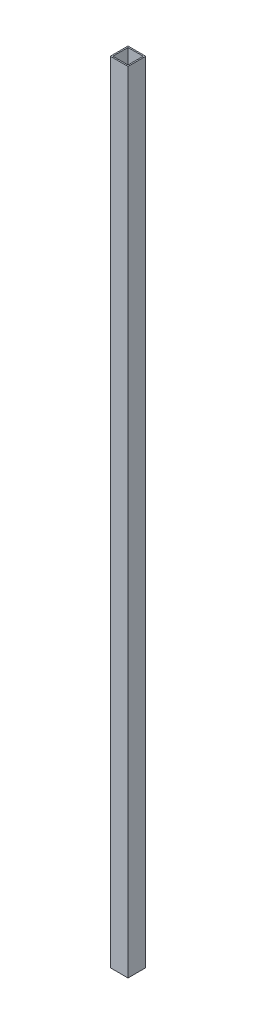
ISO-10303-21;
HEADER;
FILE_DESCRIPTION(('STEP AP214'),'2;1');
FILE_NAME('part.step','',(''),(''),'','','');
FILE_SCHEMA(('AUTOMOTIVE_DESIGN { 1 0 10303 214 1 1 1 1 }'));
ENDSEC;
DATA;
#1=APPLICATION_CONTEXT('core data for automotive mechanical design processes');
#2=APPLICATION_PROTOCOL_DEFINITION('international standard','automotive_design',2000,#1);
#3=PRODUCT_CONTEXT('',#1,'mechanical');
#4=PRODUCT('Part','Part','',(#3));
#5=PRODUCT_RELATED_PRODUCT_CATEGORY('part','',(#4));
#6=PRODUCT_DEFINITION_FORMATION('','',#4);
#7=PRODUCT_DEFINITION_CONTEXT('part definition',#1,'design');
#8=PRODUCT_DEFINITION('design','',#6,#7);
#9=PRODUCT_DEFINITION_SHAPE('','',#8);
#10=(LENGTH_UNIT() NAMED_UNIT(*) SI_UNIT(.MILLI.,.METRE.));
#11=(NAMED_UNIT(*) PLANE_ANGLE_UNIT() SI_UNIT($,.RADIAN.));
#12=(NAMED_UNIT(*) SI_UNIT($,.STERADIAN.) SOLID_ANGLE_UNIT());
#13=UNCERTAINTY_MEASURE_WITH_UNIT(LENGTH_MEASURE(1.E-05),#10,'distance_accuracy_value','');
#14=(GEOMETRIC_REPRESENTATION_CONTEXT(3) GLOBAL_UNCERTAINTY_ASSIGNED_CONTEXT((#13)) GLOBAL_UNIT_ASSIGNED_CONTEXT((#10,
#11,#12)) REPRESENTATION_CONTEXT('',''));
#15=CARTESIAN_POINT('',(0.,0.,0.));
#16=DIRECTION('',(0.,0.,1.));
#17=DIRECTION('',(1.,0.,0.));
#18=AXIS2_PLACEMENT_3D('',#15,#16,#17);
#19=CARTESIAN_POINT('',(0.,1981.2,0.));
#20=DIRECTION('',(0.,-1.,0.));
#21=DIRECTION('',(0.,0.,-1.));
#22=AXIS2_PLACEMENT_3D('',#19,#20,#21);
#23=PLANE('',#22);
#24=DIRECTION('',(0.,0.,1.));
#25=VECTOR('',#24,1.);
#26=CARTESIAN_POINT('',(0.,1981.2,0.));
#27=LINE('',#26,#25);
#28=CARTESIAN_POINT('',(0.,1981.2,-44.45));
#29=VERTEX_POINT('',#28);
#30=CARTESIAN_POINT('',(0.,1981.2,0.));
#31=VERTEX_POINT('',#30);
#32=EDGE_CURVE('E140',#29,#31,#27,.T.);
#33=ORIENTED_EDGE('',*,*,#32,.T.);
#34=DIRECTION('',(1.,0.,0.));
#35=VECTOR('',#34,1.);
#36=CARTESIAN_POINT('',(0.,1981.2,0.));
#37=LINE('',#36,#35);
#38=CARTESIAN_POINT('',(44.45,1981.2,0.));
#39=VERTEX_POINT('',#38);
#40=EDGE_CURVE('E143',#31,#39,#37,.T.);
#41=ORIENTED_EDGE('',*,*,#40,.T.);
#42=DIRECTION('',(0.,0.,-1.));
#43=VECTOR('',#42,1.);
#44=CARTESIAN_POINT('',(44.45,1981.2,0.));
#45=LINE('',#44,#43);
#46=CARTESIAN_POINT('',(44.45,1981.2,-44.45));
#47=VERTEX_POINT('',#46);
#48=EDGE_CURVE('E146',#39,#47,#45,.T.);
#49=ORIENTED_EDGE('',*,*,#48,.T.);
#50=DIRECTION('',(-1.,0.,0.));
#51=VECTOR('',#50,1.);
#52=CARTESIAN_POINT('',(0.,1981.2,-44.45));
#53=LINE('',#52,#51);
#54=EDGE_CURVE('E148',#47,#29,#53,.T.);
#55=ORIENTED_EDGE('',*,*,#54,.T.);
#56=EDGE_LOOP('',(#33,#41,#49,#55));
#57=FACE_BOUND('',#56,.T.);
#58=DIRECTION('',(1.,0.,0.));
#59=VECTOR('',#58,1.);
#60=CARTESIAN_POINT('',(3.175,1981.2,-3.175));
#61=LINE('',#60,#59);
#62=CARTESIAN_POINT('',(3.175,1981.2,-3.175));
#63=VERTEX_POINT('',#62);
#64=CARTESIAN_POINT('',(41.275,1981.2,-3.175));
#65=VERTEX_POINT('',#64);
#66=EDGE_CURVE('E104',#63,#65,#61,.T.);
#67=ORIENTED_EDGE('',*,*,#66,.F.);
#68=DIRECTION('',(0.,0.,1.));
#69=VECTOR('',#68,1.);
#70=CARTESIAN_POINT('',(3.175,1981.2,-3.175));
#71=LINE('',#70,#69);
#72=CARTESIAN_POINT('',(3.175,1981.2,-41.275));
#73=VERTEX_POINT('',#72);
#74=EDGE_CURVE('E126',#73,#63,#71,.T.);
#75=ORIENTED_EDGE('',*,*,#74,.F.);
#76=DIRECTION('',(-1.,0.,0.));
#77=VECTOR('',#76,1.);
#78=CARTESIAN_POINT('',(3.175,1981.2,-41.275));
#79=LINE('',#78,#77);
#80=CARTESIAN_POINT('',(41.275,1981.2,-41.275));
#81=VERTEX_POINT('',#80);
#82=EDGE_CURVE('E124',#81,#73,#79,.T.);
#83=ORIENTED_EDGE('',*,*,#82,.F.);
#84=DIRECTION('',(0.,0.,-1.));
#85=VECTOR('',#84,1.);
#86=CARTESIAN_POINT('',(41.275,1981.2,-3.175));
#87=LINE('',#86,#85);
#88=EDGE_CURVE('E112',#65,#81,#87,.T.);
#89=ORIENTED_EDGE('',*,*,#88,.F.);
#90=EDGE_LOOP('',(#67,#75,#83,#89));
#91=FACE_BOUND('',#90,.T.);
#92=ADVANCED_FACE('F39',(#57,#91),#23,.F.);
#93=CARTESIAN_POINT('',(0.,0.,0.));
#94=DIRECTION('',(0.,-1.,0.));
#95=DIRECTION('',(0.,0.,-1.));
#96=AXIS2_PLACEMENT_3D('',#93,#94,#95);
#97=PLANE('',#96);
#98=DIRECTION('',(0.,0.,1.));
#99=VECTOR('',#98,1.);
#100=CARTESIAN_POINT('',(0.,0.,0.));
#101=LINE('',#100,#99);
#102=CARTESIAN_POINT('',(0.,0.,-44.45));
#103=VERTEX_POINT('',#102);
#104=CARTESIAN_POINT('',(0.,0.,0.));
#105=VERTEX_POINT('',#104);
#106=EDGE_CURVE('E120',#103,#105,#101,.T.);
#107=ORIENTED_EDGE('',*,*,#106,.F.);
#108=DIRECTION('',(-1.,0.,0.));
#109=VECTOR('',#108,1.);
#110=CARTESIAN_POINT('',(0.,0.,-44.45));
#111=LINE('',#110,#109);
#112=CARTESIAN_POINT('',(44.45,0.,-44.45));
#113=VERTEX_POINT('',#112);
#114=EDGE_CURVE('E144',#113,#103,#111,.T.);
#115=ORIENTED_EDGE('',*,*,#114,.F.);
#116=DIRECTION('',(0.,0.,-1.));
#117=VECTOR('',#116,1.);
#118=CARTESIAN_POINT('',(44.45,0.,0.));
#119=LINE('',#118,#117);
#120=CARTESIAN_POINT('',(44.45,0.,0.));
#121=VERTEX_POINT('',#120);
#122=EDGE_CURVE('E155',#121,#113,#119,.T.);
#123=ORIENTED_EDGE('',*,*,#122,.F.);
#124=DIRECTION('',(1.,0.,0.));
#125=VECTOR('',#124,1.);
#126=CARTESIAN_POINT('',(0.,0.,0.));
#127=LINE('',#126,#125);
#128=EDGE_CURVE('E153',#105,#121,#127,.T.);
#129=ORIENTED_EDGE('',*,*,#128,.F.);
#130=EDGE_LOOP('',(#107,#115,#123,#129));
#131=FACE_BOUND('',#130,.T.);
#132=DIRECTION('',(0.,0.,1.));
#133=VECTOR('',#132,1.);
#134=CARTESIAN_POINT('',(3.175,0.,-3.175));
#135=LINE('',#134,#133);
#136=CARTESIAN_POINT('',(3.175,0.,-41.275));
#137=VERTEX_POINT('',#136);
#138=CARTESIAN_POINT('',(3.175,0.,-3.175));
#139=VERTEX_POINT('',#138);
#140=EDGE_CURVE('E113',#137,#139,#135,.T.);
#141=ORIENTED_EDGE('',*,*,#140,.T.);
#142=DIRECTION('',(1.,0.,0.));
#143=VECTOR('',#142,1.);
#144=CARTESIAN_POINT('',(3.175,0.,-3.175));
#145=LINE('',#144,#143);
#146=CARTESIAN_POINT('',(41.275,0.,-3.175));
#147=VERTEX_POINT('',#146);
#148=EDGE_CURVE('E62',#139,#147,#145,.T.);
#149=ORIENTED_EDGE('',*,*,#148,.T.);
#150=DIRECTION('',(0.,0.,-1.));
#151=VECTOR('',#150,1.);
#152=CARTESIAN_POINT('',(41.275,0.,-3.175));
#153=LINE('',#152,#151);
#154=CARTESIAN_POINT('',(41.275,0.,-41.275));
#155=VERTEX_POINT('',#154);
#156=EDGE_CURVE('E119',#147,#155,#153,.T.);
#157=ORIENTED_EDGE('',*,*,#156,.T.);
#158=DIRECTION('',(-1.,0.,0.));
#159=VECTOR('',#158,1.);
#160=CARTESIAN_POINT('',(3.175,0.,-41.275));
#161=LINE('',#160,#159);
#162=EDGE_CURVE('E132',#155,#137,#161,.T.);
#163=ORIENTED_EDGE('',*,*,#162,.T.);
#164=EDGE_LOOP('',(#141,#149,#157,#163));
#165=FACE_BOUND('',#164,.T.);
#166=ADVANCED_FACE('F173',(#131,#165),#97,.T.);
#167=CARTESIAN_POINT('',(0.,1981.2,0.));
#168=DIRECTION('',(1.,0.,0.));
#169=DIRECTION('',(0.,0.,-1.));
#170=AXIS2_PLACEMENT_3D('',#167,#168,#169);
#171=PLANE('',#170);
#172=ORIENTED_EDGE('',*,*,#106,.T.);
#173=DIRECTION('',(0.,-1.,0.));
#174=VECTOR('',#173,1.);
#175=CARTESIAN_POINT('',(0.,1981.2,0.));
#176=LINE('',#175,#174);
#177=EDGE_CURVE('E11',#31,#105,#176,.T.);
#178=ORIENTED_EDGE('',*,*,#177,.F.);
#179=ORIENTED_EDGE('',*,*,#32,.F.);
#180=DIRECTION('',(0.,-1.,0.));
#181=VECTOR('',#180,1.);
#182=CARTESIAN_POINT('',(0.,1981.2,-44.45));
#183=LINE('',#182,#181);
#184=EDGE_CURVE('E150',#29,#103,#183,.T.);
#185=ORIENTED_EDGE('',*,*,#184,.T.);
#186=EDGE_LOOP('',(#172,#178,#179,#185));
#187=FACE_BOUND('',#186,.T.);
#188=ADVANCED_FACE('F41',(#187),#171,.F.);
#189=CARTESIAN_POINT('',(0.,1981.2,0.));
#190=DIRECTION('',(0.,0.,-1.));
#191=DIRECTION('',(-1.,0.,0.));
#192=AXIS2_PLACEMENT_3D('',#189,#190,#191);
#193=PLANE('',#192);
#194=ORIENTED_EDGE('',*,*,#128,.T.);
#195=DIRECTION('',(0.,-1.,0.));
#196=VECTOR('',#195,1.);
#197=CARTESIAN_POINT('',(44.45,1981.2,0.));
#198=LINE('',#197,#196);
#199=EDGE_CURVE('E47',#39,#121,#198,.T.);
#200=ORIENTED_EDGE('',*,*,#199,.F.);
#201=ORIENTED_EDGE('',*,*,#40,.F.);
#202=ORIENTED_EDGE('',*,*,#177,.T.);
#203=EDGE_LOOP('',(#194,#200,#201,#202));
#204=FACE_BOUND('',#203,.T.);
#205=ADVANCED_FACE('F183',(#204),#193,.F.);
#206=CARTESIAN_POINT('',(44.45,1981.2,0.));
#207=DIRECTION('',(-1.,0.,0.));
#208=DIRECTION('',(0.,0.,1.));
#209=AXIS2_PLACEMENT_3D('',#206,#207,#208);
#210=PLANE('',#209);
#211=ORIENTED_EDGE('',*,*,#122,.T.);
#212=DIRECTION('',(0.,-1.,0.));
#213=VECTOR('',#212,1.);
#214=CARTESIAN_POINT('',(44.45,1981.2,-44.45));
#215=LINE('',#214,#213);
#216=EDGE_CURVE('E160',#47,#113,#215,.T.);
#217=ORIENTED_EDGE('',*,*,#216,.F.);
#218=ORIENTED_EDGE('',*,*,#48,.F.);
#219=ORIENTED_EDGE('',*,*,#199,.T.);
#220=EDGE_LOOP('',(#211,#217,#218,#219));
#221=FACE_BOUND('',#220,.T.);
#222=ADVANCED_FACE('F167',(#221),#210,.F.);
#223=CARTESIAN_POINT('',(0.,1981.2,-44.45));
#224=DIRECTION('',(0.,0.,1.));
#225=DIRECTION('',(1.,0.,0.));
#226=AXIS2_PLACEMENT_3D('',#223,#224,#225);
#227=PLANE('',#226);
#228=ORIENTED_EDGE('',*,*,#114,.T.);
#229=ORIENTED_EDGE('',*,*,#184,.F.);
#230=ORIENTED_EDGE('',*,*,#54,.F.);
#231=ORIENTED_EDGE('',*,*,#216,.T.);
#232=EDGE_LOOP('',(#228,#229,#230,#231));
#233=FACE_BOUND('',#232,.T.);
#234=ADVANCED_FACE('F177',(#233),#227,.F.);
#235=CARTESIAN_POINT('',(3.175,1981.2,-3.175));
#236=DIRECTION('',(0.,0.,-1.));
#237=DIRECTION('',(-1.,0.,0.));
#238=AXIS2_PLACEMENT_3D('',#235,#236,#237);
#239=PLANE('',#238);
#240=ORIENTED_EDGE('',*,*,#148,.F.);
#241=DIRECTION('',(0.,-1.,0.));
#242=VECTOR('',#241,1.);
#243=CARTESIAN_POINT('',(3.175,1981.2,-3.175));
#244=LINE('',#243,#242);
#245=EDGE_CURVE('E108',#63,#139,#244,.T.);
#246=ORIENTED_EDGE('',*,*,#245,.F.);
#247=ORIENTED_EDGE('',*,*,#66,.T.);
#248=DIRECTION('',(0.,-1.,0.));
#249=VECTOR('',#248,1.);
#250=CARTESIAN_POINT('',(41.275,1981.2,-3.175));
#251=LINE('',#250,#249);
#252=EDGE_CURVE('E107',#65,#147,#251,.T.);
#253=ORIENTED_EDGE('',*,*,#252,.T.);
#254=EDGE_LOOP('',(#240,#246,#247,#253));
#255=FACE_BOUND('',#254,.T.);
#256=ADVANCED_FACE('F106',(#255),#239,.T.);
#257=CARTESIAN_POINT('',(41.275,1981.2,-3.175));
#258=DIRECTION('',(-1.,0.,0.));
#259=DIRECTION('',(0.,0.,1.));
#260=AXIS2_PLACEMENT_3D('',#257,#258,#259);
#261=PLANE('',#260);
#262=ORIENTED_EDGE('',*,*,#156,.F.);
#263=ORIENTED_EDGE('',*,*,#252,.F.);
#264=ORIENTED_EDGE('',*,*,#88,.T.);
#265=DIRECTION('',(0.,-1.,0.));
#266=VECTOR('',#265,1.);
#267=CARTESIAN_POINT('',(41.275,1981.2,-41.275));
#268=LINE('',#267,#266);
#269=EDGE_CURVE('E121',#81,#155,#268,.T.);
#270=ORIENTED_EDGE('',*,*,#269,.T.);
#271=EDGE_LOOP('',(#262,#263,#264,#270));
#272=FACE_BOUND('',#271,.T.);
#273=ADVANCED_FACE('F116',(#272),#261,.T.);
#274=CARTESIAN_POINT('',(3.175,1981.2,-41.275));
#275=DIRECTION('',(0.,0.,1.));
#276=DIRECTION('',(1.,0.,0.));
#277=AXIS2_PLACEMENT_3D('',#274,#275,#276);
#278=PLANE('',#277);
#279=ORIENTED_EDGE('',*,*,#162,.F.);
#280=ORIENTED_EDGE('',*,*,#269,.F.);
#281=ORIENTED_EDGE('',*,*,#82,.T.);
#282=DIRECTION('',(0.,-1.,0.));
#283=VECTOR('',#282,1.);
#284=CARTESIAN_POINT('',(3.175,1981.2,-41.275));
#285=LINE('',#284,#283);
#286=EDGE_CURVE('E54',#73,#137,#285,.T.);
#287=ORIENTED_EDGE('',*,*,#286,.T.);
#288=EDGE_LOOP('',(#279,#280,#281,#287));
#289=FACE_BOUND('',#288,.T.);
#290=ADVANCED_FACE('F206',(#289),#278,.T.);
#291=CARTESIAN_POINT('',(3.175,1981.2,-3.175));
#292=DIRECTION('',(1.,0.,0.));
#293=DIRECTION('',(0.,0.,-1.));
#294=AXIS2_PLACEMENT_3D('',#291,#292,#293);
#295=PLANE('',#294);
#296=ORIENTED_EDGE('',*,*,#140,.F.);
#297=ORIENTED_EDGE('',*,*,#286,.F.);
#298=ORIENTED_EDGE('',*,*,#74,.T.);
#299=ORIENTED_EDGE('',*,*,#245,.T.);
#300=EDGE_LOOP('',(#296,#297,#298,#299));
#301=FACE_BOUND('',#300,.T.);
#302=ADVANCED_FACE('F210',(#301),#295,.T.);
#303=CLOSED_SHELL('',(#92,#166,#188,#205,#222,#234,#256,#273,#290,#302));
#304=MANIFOLD_SOLID_BREP('B2',#303);
#305=ADVANCED_BREP_SHAPE_REPRESENTATION('',(#18,#304),#14);
#306=SHAPE_DEFINITION_REPRESENTATION(#9,#305);
ENDSEC;
END-ISO-10303-21;
